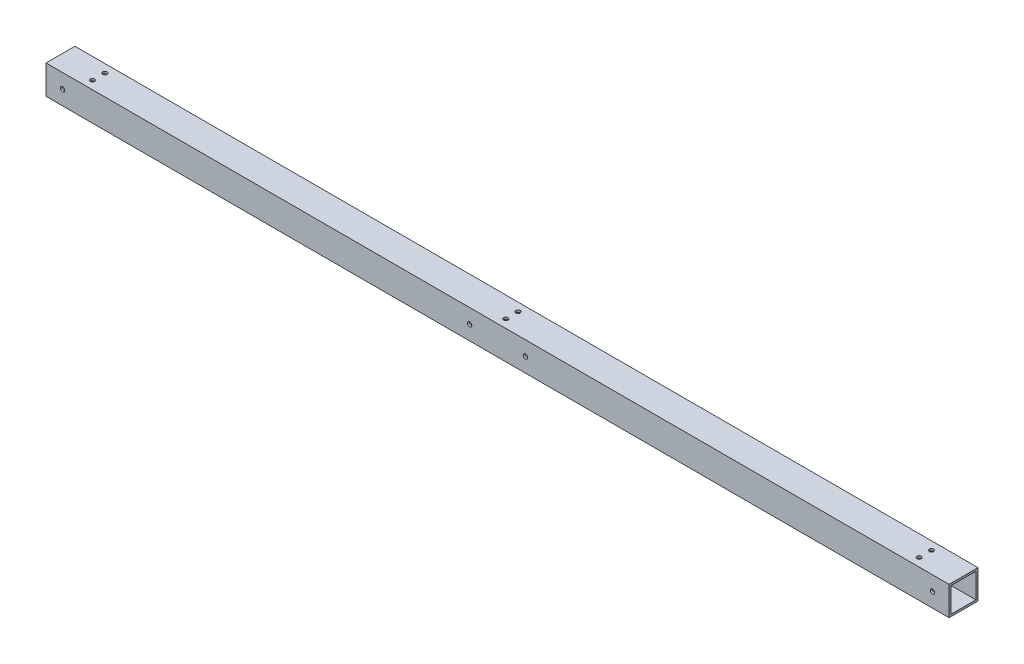
ISO-10303-21;
HEADER;
FILE_DESCRIPTION(('STEP AP214'),'2;1');
FILE_NAME('part.step','',(''),(''),'','','');
FILE_SCHEMA(('AUTOMOTIVE_DESIGN { 1 0 10303 214 1 1 1 1 }'));
ENDSEC;
DATA;
#1=APPLICATION_CONTEXT('core data for automotive mechanical design processes');
#2=APPLICATION_PROTOCOL_DEFINITION('international standard','automotive_design',2000,#1);
#3=PRODUCT_CONTEXT('',#1,'mechanical');
#4=PRODUCT('Part','Part','',(#3));
#5=PRODUCT_RELATED_PRODUCT_CATEGORY('part','',(#4));
#6=PRODUCT_DEFINITION_FORMATION('','',#4);
#7=PRODUCT_DEFINITION_CONTEXT('part definition',#1,'design');
#8=PRODUCT_DEFINITION('design','',#6,#7);
#9=PRODUCT_DEFINITION_SHAPE('','',#8);
#10=(LENGTH_UNIT() NAMED_UNIT(*) SI_UNIT(.MILLI.,.METRE.));
#11=(NAMED_UNIT(*) PLANE_ANGLE_UNIT() SI_UNIT($,.RADIAN.));
#12=(NAMED_UNIT(*) SI_UNIT($,.STERADIAN.) SOLID_ANGLE_UNIT());
#13=UNCERTAINTY_MEASURE_WITH_UNIT(LENGTH_MEASURE(1.E-05),#10,'distance_accuracy_value','');
#14=(GEOMETRIC_REPRESENTATION_CONTEXT(3) GLOBAL_UNCERTAINTY_ASSIGNED_CONTEXT((#13)) GLOBAL_UNIT_ASSIGNED_CONTEXT((#10,
#11,#12)) REPRESENTATION_CONTEXT('',''));
#15=CARTESIAN_POINT('',(0.,0.,0.));
#16=DIRECTION('',(0.,0.,1.));
#17=DIRECTION('',(1.,0.,0.));
#18=AXIS2_PLACEMENT_3D('',#15,#16,#17);
#19=CARTESIAN_POINT('',(-693.7375,-22.225,-22.225));
#20=DIRECTION('',(0.,0.,-1.));
#21=DIRECTION('',(-1.,0.,0.));
#22=AXIS2_PLACEMENT_3D('',#19,#20,#21);
#23=PLANE('',#22);
#24=CARTESIAN_POINT('',(42.8624999999999,2.33146835171283E-12,-22.225));
#25=DIRECTION('',(0.,0.,1.));
#26=DIRECTION('',(1.,0.,0.));
#27=AXIS2_PLACEMENT_3D('',#24,#25,#26);
#28=CIRCLE('',#27,3.37350099999999);
#29=CARTESIAN_POINT('',(46.2360009999999,2.33146835171283E-12,-22.225));
#30=VERTEX_POINT('',#29);
#31=EDGE_CURVE('E222',#30,#30,#28,.T.);
#32=ORIENTED_EDGE('',*,*,#31,.T.);
#33=EDGE_LOOP('',(#32));
#34=FACE_BOUND('',#33,.T.);
#35=CARTESIAN_POINT('',(-668.3375,0.,-22.225));
#36=DIRECTION('',(0.,0.,1.));
#37=DIRECTION('',(1.,0.,0.));
#38=AXIS2_PLACEMENT_3D('',#35,#36,#37);
#39=CIRCLE('',#38,3.373501);
#40=CARTESIAN_POINT('',(-664.963999,0.,-22.225));
#41=VERTEX_POINT('',#40);
#42=EDGE_CURVE('E216',#41,#41,#39,.T.);
#43=ORIENTED_EDGE('',*,*,#42,.T.);
#44=EDGE_LOOP('',(#43));
#45=FACE_BOUND('',#44,.T.);
#46=CARTESIAN_POINT('',(668.3375,2.33146835171283E-12,-22.225));
#47=DIRECTION('',(0.,0.,1.));
#48=DIRECTION('',(1.,0.,0.));
#49=AXIS2_PLACEMENT_3D('',#46,#47,#48);
#50=CIRCLE('',#49,3.373501);
#51=CARTESIAN_POINT('',(671.711001,2.33146835171283E-12,-22.225));
#52=VERTEX_POINT('',#51);
#53=EDGE_CURVE('E210',#52,#52,#50,.T.);
#54=ORIENTED_EDGE('',*,*,#53,.T.);
#55=EDGE_LOOP('',(#54));
#56=FACE_BOUND('',#55,.T.);
#57=CARTESIAN_POINT('',(-42.8625000000004,0.,-22.225));
#58=DIRECTION('',(0.,0.,1.));
#59=DIRECTION('',(1.,0.,0.));
#60=AXIS2_PLACEMENT_3D('',#57,#58,#59);
#61=CIRCLE('',#60,3.37350099999999);
#62=CARTESIAN_POINT('',(-39.4889990000004,0.,-22.225));
#63=VERTEX_POINT('',#62);
#64=EDGE_CURVE('E204',#63,#63,#61,.T.);
#65=ORIENTED_EDGE('',*,*,#64,.T.);
#66=EDGE_LOOP('',(#65));
#67=FACE_BOUND('',#66,.T.);
#68=DIRECTION('',(1.,0.,0.));
#69=VECTOR('',#68,1.);
#70=CARTESIAN_POINT('',(-693.7375,22.225,-22.225));
#71=LINE('',#70,#69);
#72=CARTESIAN_POINT('',(-693.7375,22.225,-22.225));
#73=VERTEX_POINT('',#72);
#74=CARTESIAN_POINT('',(693.7375,22.2250000000023,-22.225));
#75=VERTEX_POINT('',#74);
#76=EDGE_CURVE('E191',#73,#75,#71,.T.);
#77=ORIENTED_EDGE('',*,*,#76,.T.);
#78=DIRECTION('',(0.,1.,0.));
#79=VECTOR('',#78,1.);
#80=CARTESIAN_POINT('',(693.7375,-22.2249999999977,-22.225));
#81=LINE('',#80,#79);
#82=CARTESIAN_POINT('',(693.7375,-22.2249999999977,-22.225));
#83=VERTEX_POINT('',#82);
#84=EDGE_CURVE('E144',#83,#75,#81,.T.);
#85=ORIENTED_EDGE('',*,*,#84,.F.);
#86=DIRECTION('',(1.,0.,0.));
#87=VECTOR('',#86,1.);
#88=CARTESIAN_POINT('',(-693.7375,-22.225,-22.225));
#89=LINE('',#88,#87);
#90=CARTESIAN_POINT('',(-693.7375,-22.225,-22.225));
#91=VERTEX_POINT('',#90);
#92=EDGE_CURVE('E11',#91,#83,#89,.T.);
#93=ORIENTED_EDGE('',*,*,#92,.F.);
#94=DIRECTION('',(0.,1.,0.));
#95=VECTOR('',#94,1.);
#96=CARTESIAN_POINT('',(-693.7375,-22.225,-22.225));
#97=LINE('',#96,#95);
#98=EDGE_CURVE('E172',#91,#73,#97,.T.);
#99=ORIENTED_EDGE('',*,*,#98,.T.);
#100=EDGE_LOOP('',(#77,#85,#93,#99));
#101=FACE_BOUND('',#100,.T.);
#102=ADVANCED_FACE('F40',(#34,#45,#56,#67,#101),#23,.T.);
#103=CARTESIAN_POINT('',(-693.7375,-22.225,22.225));
#104=DIRECTION('',(0.,-1.,0.));
#105=DIRECTION('',(0.,0.,-1.));
#106=AXIS2_PLACEMENT_3D('',#103,#104,#105);
#107=PLANE('',#106);
#108=CARTESIAN_POINT('',(0.,-22.225,-9.525));
#109=DIRECTION('',(0.,-1.,0.));
#110=DIRECTION('',(0.,0.,-1.));
#111=AXIS2_PLACEMENT_3D('',#108,#109,#110);
#112=CIRCLE('',#111,3.37350099999999);
#113=CARTESIAN_POINT('',(0.,-22.225,-12.898501));
#114=VERTEX_POINT('',#113);
#115=EDGE_CURVE('E728',#114,#114,#112,.T.);
#116=ORIENTED_EDGE('',*,*,#115,.F.);
#117=EDGE_LOOP('',(#116));
#118=FACE_BOUND('',#117,.T.);
#119=CARTESIAN_POINT('',(0.,-22.225,9.525));
#120=DIRECTION('',(0.,-1.,0.));
#121=DIRECTION('',(0.,0.,-1.));
#122=AXIS2_PLACEMENT_3D('',#119,#120,#121);
#123=CIRCLE('',#122,3.37350099999999);
#124=CARTESIAN_POINT('',(0.,-22.225,6.15149900000001));
#125=VERTEX_POINT('',#124);
#126=EDGE_CURVE('E254',#125,#125,#123,.T.);
#127=ORIENTED_EDGE('',*,*,#126,.F.);
#128=EDGE_LOOP('',(#127));
#129=FACE_BOUND('',#128,.T.);
#130=CARTESIAN_POINT('',(635.,-22.2249999999977,-9.525));
#131=DIRECTION('',(0.,-1.,0.));
#132=DIRECTION('',(0.,0.,-1.));
#133=AXIS2_PLACEMENT_3D('',#130,#131,#132);
#134=CIRCLE('',#133,3.373501);
#135=CARTESIAN_POINT('',(635.,-22.2249999999977,-12.898501));
#136=VERTEX_POINT('',#135);
#137=EDGE_CURVE('E251',#136,#136,#134,.T.);
#138=ORIENTED_EDGE('',*,*,#137,.F.);
#139=EDGE_LOOP('',(#138));
#140=FACE_BOUND('',#139,.T.);
#141=CARTESIAN_POINT('',(635.,-22.2249999999977,9.525));
#142=DIRECTION('',(0.,-1.,0.));
#143=DIRECTION('',(0.,0.,-1.));
#144=AXIS2_PLACEMENT_3D('',#141,#142,#143);
#145=CIRCLE('',#144,3.373501);
#146=CARTESIAN_POINT('',(635.,-22.2249999999977,6.151499));
#147=VERTEX_POINT('',#146);
#148=EDGE_CURVE('E274',#147,#147,#145,.T.);
#149=ORIENTED_EDGE('',*,*,#148,.F.);
#150=EDGE_LOOP('',(#149));
#151=FACE_BOUND('',#150,.T.);
#152=CARTESIAN_POINT('',(-635.,-22.225,9.525));
#153=DIRECTION('',(0.,-1.,0.));
#154=DIRECTION('',(0.,0.,-1.));
#155=AXIS2_PLACEMENT_3D('',#152,#153,#154);
#156=CIRCLE('',#155,3.373501);
#157=CARTESIAN_POINT('',(-635.,-22.225,6.151499));
#158=VERTEX_POINT('',#157);
#159=EDGE_CURVE('E290',#158,#158,#156,.T.);
#160=ORIENTED_EDGE('',*,*,#159,.F.);
#161=EDGE_LOOP('',(#160));
#162=FACE_BOUND('',#161,.T.);
#163=CARTESIAN_POINT('',(-635.,-22.225,-9.525));
#164=DIRECTION('',(0.,-1.,0.));
#165=DIRECTION('',(0.,0.,-1.));
#166=AXIS2_PLACEMENT_3D('',#163,#164,#165);
#167=CIRCLE('',#166,3.373501);
#168=CARTESIAN_POINT('',(-635.,-22.225,-12.898501));
#169=VERTEX_POINT('',#168);
#170=EDGE_CURVE('E300',#169,#169,#167,.T.);
#171=ORIENTED_EDGE('',*,*,#170,.F.);
#172=EDGE_LOOP('',(#171));
#173=FACE_BOUND('',#172,.T.);
#174=ORIENTED_EDGE('',*,*,#92,.T.);
#175=DIRECTION('',(0.,0.,-1.));
#176=VECTOR('',#175,1.);
#177=CARTESIAN_POINT('',(693.7375,-22.2249999999977,22.225));
#178=LINE('',#177,#176);
#179=CARTESIAN_POINT('',(693.7375,-22.2249999999977,22.225));
#180=VERTEX_POINT('',#179);
#181=EDGE_CURVE('E156',#180,#83,#178,.T.);
#182=ORIENTED_EDGE('',*,*,#181,.F.);
#183=DIRECTION('',(1.,0.,0.));
#184=VECTOR('',#183,1.);
#185=CARTESIAN_POINT('',(-693.7375,-22.225,22.225));
#186=LINE('',#185,#184);
#187=CARTESIAN_POINT('',(-693.7375,-22.225,22.225));
#188=VERTEX_POINT('',#187);
#189=EDGE_CURVE('E49',#188,#180,#186,.T.);
#190=ORIENTED_EDGE('',*,*,#189,.F.);
#191=DIRECTION('',(0.,0.,-1.));
#192=VECTOR('',#191,1.);
#193=CARTESIAN_POINT('',(-693.7375,-22.225,22.225));
#194=LINE('',#193,#192);
#195=EDGE_CURVE('E188',#188,#91,#194,.T.);
#196=ORIENTED_EDGE('',*,*,#195,.T.);
#197=EDGE_LOOP('',(#174,#182,#190,#196));
#198=FACE_BOUND('',#197,.T.);
#199=ADVANCED_FACE('F369',(#118,#129,#140,#151,#162,#173,#198),#107,.T.);
#200=CARTESIAN_POINT('',(-693.7375,-22.225,22.225));
#201=DIRECTION('',(0.,0.,1.));
#202=DIRECTION('',(1.,0.,0.));
#203=AXIS2_PLACEMENT_3D('',#200,#201,#202);
#204=PLANE('',#203);
#205=CARTESIAN_POINT('',(42.8624999999999,2.33146835171283E-12,22.225));
#206=DIRECTION('',(0.,0.,1.));
#207=DIRECTION('',(1.,0.,0.));
#208=AXIS2_PLACEMENT_3D('',#205,#206,#207);
#209=CIRCLE('',#208,3.37350099999999);
#210=CARTESIAN_POINT('',(46.2360009999999,2.33146835171283E-12,22.225));
#211=VERTEX_POINT('',#210);
#212=EDGE_CURVE('E310',#211,#211,#209,.T.);
#213=ORIENTED_EDGE('',*,*,#212,.F.);
#214=EDGE_LOOP('',(#213));
#215=FACE_BOUND('',#214,.T.);
#216=CARTESIAN_POINT('',(-668.3375,0.,22.225));
#217=DIRECTION('',(0.,0.,1.));
#218=DIRECTION('',(1.,0.,0.));
#219=AXIS2_PLACEMENT_3D('',#216,#217,#218);
#220=CIRCLE('',#219,3.373501);
#221=CARTESIAN_POINT('',(-664.963999,0.,22.225));
#222=VERTEX_POINT('',#221);
#223=EDGE_CURVE('E320',#222,#222,#220,.T.);
#224=ORIENTED_EDGE('',*,*,#223,.F.);
#225=EDGE_LOOP('',(#224));
#226=FACE_BOUND('',#225,.T.);
#227=CARTESIAN_POINT('',(668.3375,2.33146835171283E-12,22.225));
#228=DIRECTION('',(0.,0.,1.));
#229=DIRECTION('',(1.,0.,0.));
#230=AXIS2_PLACEMENT_3D('',#227,#228,#229);
#231=CIRCLE('',#230,3.373501);
#232=CARTESIAN_POINT('',(671.711001,2.33146835171283E-12,22.225));
#233=VERTEX_POINT('',#232);
#234=EDGE_CURVE('E330',#233,#233,#231,.T.);
#235=ORIENTED_EDGE('',*,*,#234,.F.);
#236=EDGE_LOOP('',(#235));
#237=FACE_BOUND('',#236,.T.);
#238=CARTESIAN_POINT('',(-42.8625000000004,0.,22.225));
#239=DIRECTION('',(0.,0.,1.));
#240=DIRECTION('',(1.,0.,0.));
#241=AXIS2_PLACEMENT_3D('',#238,#239,#240);
#242=CIRCLE('',#241,3.37350099999999);
#243=CARTESIAN_POINT('',(-39.4889990000004,0.,22.225));
#244=VERTEX_POINT('',#243);
#245=EDGE_CURVE('E340',#244,#244,#242,.T.);
#246=ORIENTED_EDGE('',*,*,#245,.F.);
#247=EDGE_LOOP('',(#246));
#248=FACE_BOUND('',#247,.T.);
#249=ORIENTED_EDGE('',*,*,#189,.T.);
#250=DIRECTION('',(0.,-1.,0.));
#251=VECTOR('',#250,1.);
#252=CARTESIAN_POINT('',(693.7375,-22.2249999999977,22.225));
#253=LINE('',#252,#251);
#254=CARTESIAN_POINT('',(693.7375,22.2250000000023,22.225));
#255=VERTEX_POINT('',#254);
#256=EDGE_CURVE('E152',#255,#180,#253,.T.);
#257=ORIENTED_EDGE('',*,*,#256,.F.);
#258=DIRECTION('',(1.,0.,0.));
#259=VECTOR('',#258,1.);
#260=CARTESIAN_POINT('',(-693.7375,22.225,22.225));
#261=LINE('',#260,#259);
#262=CARTESIAN_POINT('',(-693.7375,22.225,22.225));
#263=VERTEX_POINT('',#262);
#264=EDGE_CURVE('E195',#263,#255,#261,.T.);
#265=ORIENTED_EDGE('',*,*,#264,.F.);
#266=DIRECTION('',(0.,-1.,0.));
#267=VECTOR('',#266,1.);
#268=CARTESIAN_POINT('',(-693.7375,-22.225,22.225));
#269=LINE('',#268,#267);
#270=EDGE_CURVE('E184',#263,#188,#269,.T.);
#271=ORIENTED_EDGE('',*,*,#270,.T.);
#272=EDGE_LOOP('',(#249,#257,#265,#271));
#273=FACE_BOUND('',#272,.T.);
#274=ADVANCED_FACE('F374',(#215,#226,#237,#248,#273),#204,.T.);
#275=CARTESIAN_POINT('',(-693.7375,22.225,22.225));
#276=DIRECTION('',(0.,1.,0.));
#277=DIRECTION('',(0.,0.,1.));
#278=AXIS2_PLACEMENT_3D('',#275,#276,#277);
#279=PLANE('',#278);
#280=CARTESIAN_POINT('',(0.,22.225,-9.525));
#281=DIRECTION('',(0.,-1.,0.));
#282=DIRECTION('',(0.,0.,-1.));
#283=AXIS2_PLACEMENT_3D('',#280,#281,#282);
#284=CIRCLE('',#283,3.37350099999999);
#285=CARTESIAN_POINT('',(0.,22.225,-12.898501));
#286=VERTEX_POINT('',#285);
#287=EDGE_CURVE('E718',#286,#286,#284,.T.);
#288=ORIENTED_EDGE('',*,*,#287,.T.);
#289=EDGE_LOOP('',(#288));
#290=FACE_BOUND('',#289,.T.);
#291=CARTESIAN_POINT('',(0.,22.225,9.525));
#292=DIRECTION('',(0.,-1.,0.));
#293=DIRECTION('',(0.,0.,-1.));
#294=AXIS2_PLACEMENT_3D('',#291,#292,#293);
#295=CIRCLE('',#294,3.37350099999999);
#296=CARTESIAN_POINT('',(0.,22.225,6.15149900000001));
#297=VERTEX_POINT('',#296);
#298=EDGE_CURVE('E244',#297,#297,#295,.T.);
#299=ORIENTED_EDGE('',*,*,#298,.T.);
#300=EDGE_LOOP('',(#299));
#301=FACE_BOUND('',#300,.T.);
#302=CARTESIAN_POINT('',(635.,22.2250000000023,-9.525));
#303=DIRECTION('',(0.,-1.,0.));
#304=DIRECTION('',(0.,0.,-1.));
#305=AXIS2_PLACEMENT_3D('',#302,#303,#304);
#306=CIRCLE('',#305,3.373501);
#307=CARTESIAN_POINT('',(635.,22.2250000000023,-12.898501));
#308=VERTEX_POINT('',#307);
#309=EDGE_CURVE('E239',#308,#308,#306,.T.);
#310=ORIENTED_EDGE('',*,*,#309,.T.);
#311=EDGE_LOOP('',(#310));
#312=FACE_BOUND('',#311,.T.);
#313=CARTESIAN_POINT('',(635.,22.2250000000023,9.525));
#314=DIRECTION('',(0.,-1.,0.));
#315=DIRECTION('',(0.,0.,-1.));
#316=AXIS2_PLACEMENT_3D('',#313,#314,#315);
#317=CIRCLE('',#316,3.373501);
#318=CARTESIAN_POINT('',(635.,22.2250000000023,6.151499));
#319=VERTEX_POINT('',#318);
#320=EDGE_CURVE('E278',#319,#319,#317,.T.);
#321=ORIENTED_EDGE('',*,*,#320,.T.);
#322=EDGE_LOOP('',(#321));
#323=FACE_BOUND('',#322,.T.);
#324=CARTESIAN_POINT('',(-635.,22.225,9.525));
#325=DIRECTION('',(0.,-1.,0.));
#326=DIRECTION('',(0.,0.,-1.));
#327=AXIS2_PLACEMENT_3D('',#324,#325,#326);
#328=CIRCLE('',#327,3.373501);
#329=CARTESIAN_POINT('',(-635.,22.225,6.151499));
#330=VERTEX_POINT('',#329);
#331=EDGE_CURVE('E234',#330,#330,#328,.T.);
#332=ORIENTED_EDGE('',*,*,#331,.T.);
#333=EDGE_LOOP('',(#332));
#334=FACE_BOUND('',#333,.T.);
#335=CARTESIAN_POINT('',(-635.,22.225,-9.525));
#336=DIRECTION('',(0.,-1.,0.));
#337=DIRECTION('',(0.,0.,-1.));
#338=AXIS2_PLACEMENT_3D('',#335,#336,#337);
#339=CIRCLE('',#338,3.373501);
#340=CARTESIAN_POINT('',(-635.,22.225,-12.898501));
#341=VERTEX_POINT('',#340);
#342=EDGE_CURVE('E228',#341,#341,#339,.T.);
#343=ORIENTED_EDGE('',*,*,#342,.T.);
#344=EDGE_LOOP('',(#343));
#345=FACE_BOUND('',#344,.T.);
#346=ORIENTED_EDGE('',*,*,#264,.T.);
#347=DIRECTION('',(0.,0.,1.));
#348=VECTOR('',#347,1.);
#349=CARTESIAN_POINT('',(693.7375,22.2250000000023,22.225));
#350=LINE('',#349,#348);
#351=EDGE_CURVE('E148',#75,#255,#350,.T.);
#352=ORIENTED_EDGE('',*,*,#351,.F.);
#353=ORIENTED_EDGE('',*,*,#76,.F.);
#354=DIRECTION('',(0.,0.,1.));
#355=VECTOR('',#354,1.);
#356=CARTESIAN_POINT('',(-693.7375,22.225,22.225));
#357=LINE('',#356,#355);
#358=EDGE_CURVE('E180',#73,#263,#357,.T.);
#359=ORIENTED_EDGE('',*,*,#358,.T.);
#360=EDGE_LOOP('',(#346,#352,#353,#359));
#361=FACE_BOUND('',#360,.T.);
#362=ADVANCED_FACE('F386',(#290,#301,#312,#323,#334,#345,#361),#279,.T.);
#363=CARTESIAN_POINT('',(-693.7375,0.,0.));
#364=DIRECTION('',(-1.,0.,0.));
#365=DIRECTION('',(0.,0.,1.));
#366=AXIS2_PLACEMENT_3D('',#363,#364,#365);
#367=PLANE('',#366);
#368=DIRECTION('',(0.,1.,0.));
#369=VECTOR('',#368,1.);
#370=CARTESIAN_POINT('',(-693.7375,-19.05,-19.05));
#371=LINE('',#370,#369);
#372=CARTESIAN_POINT('',(-693.7375,-19.05,-19.05));
#373=VERTEX_POINT('',#372);
#374=CARTESIAN_POINT('',(-693.7375,19.05,-19.05));
#375=VERTEX_POINT('',#374);
#376=EDGE_CURVE('E160',#373,#375,#371,.T.);
#377=ORIENTED_EDGE('',*,*,#376,.T.);
#378=DIRECTION('',(0.,0.,1.));
#379=VECTOR('',#378,1.);
#380=CARTESIAN_POINT('',(-693.7375,19.05,19.05));
#381=LINE('',#380,#379);
#382=CARTESIAN_POINT('',(-693.7375,19.05,19.05));
#383=VERTEX_POINT('',#382);
#384=EDGE_CURVE('E113',#375,#383,#381,.T.);
#385=ORIENTED_EDGE('',*,*,#384,.T.);
#386=DIRECTION('',(0.,-1.,0.));
#387=VECTOR('',#386,1.);
#388=CARTESIAN_POINT('',(-693.7375,-19.05,19.05));
#389=LINE('',#388,#387);
#390=CARTESIAN_POINT('',(-693.7375,-19.05,19.05));
#391=VERTEX_POINT('',#390);
#392=EDGE_CURVE('E57',#383,#391,#389,.T.);
#393=ORIENTED_EDGE('',*,*,#392,.T.);
#394=DIRECTION('',(0.,0.,-1.));
#395=VECTOR('',#394,1.);
#396=CARTESIAN_POINT('',(-693.7375,-19.05,19.05));
#397=LINE('',#396,#395);
#398=EDGE_CURVE('E119',#391,#373,#397,.T.);
#399=ORIENTED_EDGE('',*,*,#398,.T.);
#400=EDGE_LOOP('',(#377,#385,#393,#399));
#401=FACE_BOUND('',#400,.T.);
#402=ORIENTED_EDGE('',*,*,#98,.F.);
#403=ORIENTED_EDGE('',*,*,#195,.F.);
#404=ORIENTED_EDGE('',*,*,#270,.F.);
#405=ORIENTED_EDGE('',*,*,#358,.F.);
#406=EDGE_LOOP('',(#402,#403,#404,#405));
#407=FACE_BOUND('',#406,.T.);
#408=ADVANCED_FACE('F394',(#401,#407),#367,.T.);
#409=CARTESIAN_POINT('',(-693.7375,-19.05,-19.05));
#410=DIRECTION('',(0.,0.,-1.));
#411=DIRECTION('',(-1.,0.,0.));
#412=AXIS2_PLACEMENT_3D('',#409,#410,#411);
#413=PLANE('',#412);
#414=CARTESIAN_POINT('',(42.8624999999999,2.33146835171283E-12,-19.05));
#415=DIRECTION('',(0.,0.,-1.));
#416=DIRECTION('',(-1.,0.,0.));
#417=AXIS2_PLACEMENT_3D('',#414,#415,#416);
#418=CIRCLE('',#417,3.37350099999999);
#419=CARTESIAN_POINT('',(39.4889989999999,2.33146835171283E-12,-19.05));
#420=VERTEX_POINT('',#419);
#421=EDGE_CURVE('E221',#420,#420,#418,.T.);
#422=ORIENTED_EDGE('',*,*,#421,.T.);
#423=EDGE_LOOP('',(#422));
#424=FACE_BOUND('',#423,.T.);
#425=CARTESIAN_POINT('',(-668.3375,0.,-19.05));
#426=DIRECTION('',(0.,0.,-1.));
#427=DIRECTION('',(-1.,0.,0.));
#428=AXIS2_PLACEMENT_3D('',#425,#426,#427);
#429=CIRCLE('',#428,3.373501);
#430=CARTESIAN_POINT('',(-671.711001,0.,-19.05));
#431=VERTEX_POINT('',#430);
#432=EDGE_CURVE('E211',#431,#431,#429,.T.);
#433=ORIENTED_EDGE('',*,*,#432,.T.);
#434=EDGE_LOOP('',(#433));
#435=FACE_BOUND('',#434,.T.);
#436=CARTESIAN_POINT('',(668.3375,2.33146835171283E-12,-19.05));
#437=DIRECTION('',(0.,0.,-1.));
#438=DIRECTION('',(-1.,0.,0.));
#439=AXIS2_PLACEMENT_3D('',#436,#437,#438);
#440=CIRCLE('',#439,3.373501);
#441=CARTESIAN_POINT('',(664.963999,2.33146835171283E-12,-19.05));
#442=VERTEX_POINT('',#441);
#443=EDGE_CURVE('E205',#442,#442,#440,.T.);
#444=ORIENTED_EDGE('',*,*,#443,.T.);
#445=EDGE_LOOP('',(#444));
#446=FACE_BOUND('',#445,.T.);
#447=CARTESIAN_POINT('',(-42.8625000000004,0.,-19.05));
#448=DIRECTION('',(0.,0.,-1.));
#449=DIRECTION('',(-1.,0.,0.));
#450=AXIS2_PLACEMENT_3D('',#447,#448,#449);
#451=CIRCLE('',#450,3.37350099999999);
#452=CARTESIAN_POINT('',(-46.2360010000003,0.,-19.05));
#453=VERTEX_POINT('',#452);
#454=EDGE_CURVE('E129',#453,#453,#451,.T.);
#455=ORIENTED_EDGE('',*,*,#454,.T.);
#456=EDGE_LOOP('',(#455));
#457=FACE_BOUND('',#456,.T.);
#458=DIRECTION('',(1.,0.,0.));
#459=VECTOR('',#458,1.);
#460=CARTESIAN_POINT('',(-693.7375,-19.05,-19.05));
#461=LINE('',#460,#459);
#462=CARTESIAN_POINT('',(693.7375,-19.0499999999977,-19.05));
#463=VERTEX_POINT('',#462);
#464=EDGE_CURVE('E124',#373,#463,#461,.T.);
#465=ORIENTED_EDGE('',*,*,#464,.T.);
#466=DIRECTION('',(0.,1.,0.));
#467=VECTOR('',#466,1.);
#468=CARTESIAN_POINT('',(693.7375,-19.0499999999977,-19.05));
#469=LINE('',#468,#467);
#470=CARTESIAN_POINT('',(693.7375,19.0500000000023,-19.05));
#471=VERTEX_POINT('',#470);
#472=EDGE_CURVE('E122',#463,#471,#469,.T.);
#473=ORIENTED_EDGE('',*,*,#472,.T.);
#474=DIRECTION('',(1.,0.,0.));
#475=VECTOR('',#474,1.);
#476=CARTESIAN_POINT('',(-693.7375,19.05,-19.05));
#477=LINE('',#476,#475);
#478=EDGE_CURVE('E106',#375,#471,#477,.T.);
#479=ORIENTED_EDGE('',*,*,#478,.F.);
#480=ORIENTED_EDGE('',*,*,#376,.F.);
#481=EDGE_LOOP('',(#465,#473,#479,#480));
#482=FACE_BOUND('',#481,.T.);
#483=ADVANCED_FACE('F123',(#424,#435,#446,#457,#482),#413,.F.);
#484=CARTESIAN_POINT('',(-693.7375,-19.05,19.05));
#485=DIRECTION('',(0.,-1.,0.));
#486=DIRECTION('',(0.,0.,-1.));
#487=AXIS2_PLACEMENT_3D('',#484,#485,#486);
#488=PLANE('',#487);
#489=CARTESIAN_POINT('',(0.,-19.05,-9.525));
#490=DIRECTION('',(0.,-1.,0.));
#491=DIRECTION('',(0.,0.,-1.));
#492=AXIS2_PLACEMENT_3D('',#489,#490,#491);
#493=CIRCLE('',#492,3.37350099999999);
#494=CARTESIAN_POINT('',(0.,-19.05,-12.898501));
#495=VERTEX_POINT('',#494);
#496=EDGE_CURVE('E43',#495,#495,#493,.T.);
#497=ORIENTED_EDGE('',*,*,#496,.T.);
#498=EDGE_LOOP('',(#497));
#499=FACE_BOUND('',#498,.T.);
#500=CARTESIAN_POINT('',(0.,-19.05,9.525));
#501=DIRECTION('',(0.,-1.,0.));
#502=DIRECTION('',(0.,0.,-1.));
#503=AXIS2_PLACEMENT_3D('',#500,#501,#502);
#504=CIRCLE('',#503,3.37350099999999);
#505=CARTESIAN_POINT('',(0.,-19.05,6.15149900000001));
#506=VERTEX_POINT('',#505);
#507=EDGE_CURVE('E243',#506,#506,#504,.T.);
#508=ORIENTED_EDGE('',*,*,#507,.T.);
#509=EDGE_LOOP('',(#508));
#510=FACE_BOUND('',#509,.T.);
#511=CARTESIAN_POINT('',(635.,-19.0499999999977,-9.525));
#512=DIRECTION('',(0.,-1.,0.));
#513=DIRECTION('',(0.,0.,-1.));
#514=AXIS2_PLACEMENT_3D('',#511,#512,#513);
#515=CIRCLE('',#514,3.373501);
#516=CARTESIAN_POINT('',(635.,-19.0499999999977,-12.898501));
#517=VERTEX_POINT('',#516);
#518=EDGE_CURVE('E238',#517,#517,#515,.T.);
#519=ORIENTED_EDGE('',*,*,#518,.T.);
#520=EDGE_LOOP('',(#519));
#521=FACE_BOUND('',#520,.T.);
#522=CARTESIAN_POINT('',(635.,-19.0499999999977,9.525));
#523=DIRECTION('',(0.,-1.,0.));
#524=DIRECTION('',(0.,0.,-1.));
#525=AXIS2_PLACEMENT_3D('',#522,#523,#524);
#526=CIRCLE('',#525,3.373501);
#527=CARTESIAN_POINT('',(635.,-19.0499999999977,6.151499));
#528=VERTEX_POINT('',#527);
#529=EDGE_CURVE('E282',#528,#528,#526,.T.);
#530=ORIENTED_EDGE('',*,*,#529,.T.);
#531=EDGE_LOOP('',(#530));
#532=FACE_BOUND('',#531,.T.);
#533=CARTESIAN_POINT('',(-635.,-19.05,9.525));
#534=DIRECTION('',(0.,-1.,0.));
#535=DIRECTION('',(0.,0.,-1.));
#536=AXIS2_PLACEMENT_3D('',#533,#534,#535);
#537=CIRCLE('',#536,3.373501);
#538=CARTESIAN_POINT('',(-635.,-19.05,6.151499));
#539=VERTEX_POINT('',#538);
#540=EDGE_CURVE('E233',#539,#539,#537,.T.);
#541=ORIENTED_EDGE('',*,*,#540,.T.);
#542=EDGE_LOOP('',(#541));
#543=FACE_BOUND('',#542,.T.);
#544=CARTESIAN_POINT('',(-635.,-19.05,-9.525));
#545=DIRECTION('',(0.,-1.,0.));
#546=DIRECTION('',(0.,0.,-1.));
#547=AXIS2_PLACEMENT_3D('',#544,#545,#546);
#548=CIRCLE('',#547,3.373501);
#549=CARTESIAN_POINT('',(-635.,-19.05,-12.898501));
#550=VERTEX_POINT('',#549);
#551=EDGE_CURVE('E223',#550,#550,#548,.T.);
#552=ORIENTED_EDGE('',*,*,#551,.T.);
#553=EDGE_LOOP('',(#552));
#554=FACE_BOUND('',#553,.T.);
#555=DIRECTION('',(1.,0.,0.));
#556=VECTOR('',#555,1.);
#557=CARTESIAN_POINT('',(-693.7375,-19.05,19.05));
#558=LINE('',#557,#556);
#559=CARTESIAN_POINT('',(693.7375,-19.0499999999977,19.05));
#560=VERTEX_POINT('',#559);
#561=EDGE_CURVE('E173',#391,#560,#558,.T.);
#562=ORIENTED_EDGE('',*,*,#561,.T.);
#563=DIRECTION('',(0.,0.,-1.));
#564=VECTOR('',#563,1.);
#565=CARTESIAN_POINT('',(693.7375,-19.0499999999977,19.05));
#566=LINE('',#565,#564);
#567=EDGE_CURVE('E138',#560,#463,#566,.T.);
#568=ORIENTED_EDGE('',*,*,#567,.T.);
#569=ORIENTED_EDGE('',*,*,#464,.F.);
#570=ORIENTED_EDGE('',*,*,#398,.F.);
#571=EDGE_LOOP('',(#562,#568,#569,#570));
#572=FACE_BOUND('',#571,.T.);
#573=ADVANCED_FACE('F411',(#499,#510,#521,#532,#543,#554,#572),#488,.F.);
#574=CARTESIAN_POINT('',(-693.7375,-19.05,19.05));
#575=DIRECTION('',(0.,0.,1.));
#576=DIRECTION('',(1.,0.,0.));
#577=AXIS2_PLACEMENT_3D('',#574,#575,#576);
#578=PLANE('',#577);
#579=CARTESIAN_POINT('',(42.8624999999999,2.33146835171283E-12,19.05));
#580=DIRECTION('',(0.,0.,1.));
#581=DIRECTION('',(1.,0.,0.));
#582=AXIS2_PLACEMENT_3D('',#579,#580,#581);
#583=CIRCLE('',#582,3.37350099999999);
#584=CARTESIAN_POINT('',(46.2360009999999,2.33146835171283E-12,19.05));
#585=VERTEX_POINT('',#584);
#586=EDGE_CURVE('E217',#585,#585,#583,.T.);
#587=ORIENTED_EDGE('',*,*,#586,.T.);
#588=EDGE_LOOP('',(#587));
#589=FACE_BOUND('',#588,.T.);
#590=CARTESIAN_POINT('',(-668.3375,0.,19.05));
#591=DIRECTION('',(0.,0.,1.));
#592=DIRECTION('',(1.,0.,0.));
#593=AXIS2_PLACEMENT_3D('',#590,#591,#592);
#594=CIRCLE('',#593,3.373501);
#595=CARTESIAN_POINT('',(-664.963999,0.,19.05));
#596=VERTEX_POINT('',#595);
#597=EDGE_CURVE('E215',#596,#596,#594,.T.);
#598=ORIENTED_EDGE('',*,*,#597,.T.);
#599=EDGE_LOOP('',(#598));
#600=FACE_BOUND('',#599,.T.);
#601=CARTESIAN_POINT('',(668.3375,2.33146835171283E-12,19.05));
#602=DIRECTION('',(0.,0.,1.));
#603=DIRECTION('',(1.,0.,0.));
#604=AXIS2_PLACEMENT_3D('',#601,#602,#603);
#605=CIRCLE('',#604,3.373501);
#606=CARTESIAN_POINT('',(671.711001,2.33146835171283E-12,19.05));
#607=VERTEX_POINT('',#606);
#608=EDGE_CURVE('E209',#607,#607,#605,.T.);
#609=ORIENTED_EDGE('',*,*,#608,.T.);
#610=EDGE_LOOP('',(#609));
#611=FACE_BOUND('',#610,.T.);
#612=CARTESIAN_POINT('',(-42.8625000000004,0.,19.05));
#613=DIRECTION('',(0.,0.,1.));
#614=DIRECTION('',(1.,0.,0.));
#615=AXIS2_PLACEMENT_3D('',#612,#613,#614);
#616=CIRCLE('',#615,3.37350099999999);
#617=CARTESIAN_POINT('',(-39.4889990000004,0.,19.05));
#618=VERTEX_POINT('',#617);
#619=EDGE_CURVE('E200',#618,#618,#616,.T.);
#620=ORIENTED_EDGE('',*,*,#619,.T.);
#621=EDGE_LOOP('',(#620));
#622=FACE_BOUND('',#621,.T.);
#623=DIRECTION('',(1.,0.,0.));
#624=VECTOR('',#623,1.);
#625=CARTESIAN_POINT('',(-693.7375,19.05,19.05));
#626=LINE('',#625,#624);
#627=CARTESIAN_POINT('',(693.7375,19.0500000000023,19.05));
#628=VERTEX_POINT('',#627);
#629=EDGE_CURVE('E118',#383,#628,#626,.T.);
#630=ORIENTED_EDGE('',*,*,#629,.T.);
#631=DIRECTION('',(0.,-1.,0.));
#632=VECTOR('',#631,1.);
#633=CARTESIAN_POINT('',(693.7375,-19.0499999999977,19.05));
#634=LINE('',#633,#632);
#635=EDGE_CURVE('E133',#628,#560,#634,.T.);
#636=ORIENTED_EDGE('',*,*,#635,.T.);
#637=ORIENTED_EDGE('',*,*,#561,.F.);
#638=ORIENTED_EDGE('',*,*,#392,.F.);
#639=EDGE_LOOP('',(#630,#636,#637,#638));
#640=FACE_BOUND('',#639,.T.);
#641=ADVANCED_FACE('F415',(#589,#600,#611,#622,#640),#578,.F.);
#642=CARTESIAN_POINT('',(-693.7375,19.05,19.05));
#643=DIRECTION('',(0.,1.,0.));
#644=DIRECTION('',(0.,0.,1.));
#645=AXIS2_PLACEMENT_3D('',#642,#643,#644);
#646=PLANE('',#645);
#647=CARTESIAN_POINT('',(0.,19.05,-9.525));
#648=DIRECTION('',(0.,1.,0.));
#649=DIRECTION('',(0.,0.,1.));
#650=AXIS2_PLACEMENT_3D('',#647,#648,#649);
#651=CIRCLE('',#650,3.37350099999999);
#652=CARTESIAN_POINT('',(0.,19.05,-6.15149900000001));
#653=VERTEX_POINT('',#652);
#654=EDGE_CURVE('E261',#653,#653,#651,.T.);
#655=ORIENTED_EDGE('',*,*,#654,.T.);
#656=EDGE_LOOP('',(#655));
#657=FACE_BOUND('',#656,.T.);
#658=CARTESIAN_POINT('',(0.,19.05,9.525));
#659=DIRECTION('',(0.,1.,0.));
#660=DIRECTION('',(0.,0.,1.));
#661=AXIS2_PLACEMENT_3D('',#658,#659,#660);
#662=CIRCLE('',#661,3.37350099999999);
#663=CARTESIAN_POINT('',(0.,19.05,12.898501));
#664=VERTEX_POINT('',#663);
#665=EDGE_CURVE('E240',#664,#664,#662,.T.);
#666=ORIENTED_EDGE('',*,*,#665,.T.);
#667=EDGE_LOOP('',(#666));
#668=FACE_BOUND('',#667,.T.);
#669=CARTESIAN_POINT('',(635.,19.0500000000023,-9.525));
#670=DIRECTION('',(0.,1.,0.));
#671=DIRECTION('',(0.,0.,1.));
#672=AXIS2_PLACEMENT_3D('',#669,#670,#671);
#673=CIRCLE('',#672,3.373501);
#674=CARTESIAN_POINT('',(635.,19.0500000000023,-6.151499));
#675=VERTEX_POINT('',#674);
#676=EDGE_CURVE('E235',#675,#675,#673,.T.);
#677=ORIENTED_EDGE('',*,*,#676,.T.);
#678=EDGE_LOOP('',(#677));
#679=FACE_BOUND('',#678,.T.);
#680=CARTESIAN_POINT('',(635.,19.0500000000023,9.525));
#681=DIRECTION('',(0.,1.,0.));
#682=DIRECTION('',(0.,0.,1.));
#683=AXIS2_PLACEMENT_3D('',#680,#681,#682);
#684=CIRCLE('',#683,3.373501);
#685=CARTESIAN_POINT('',(635.,19.0500000000023,12.898501));
#686=VERTEX_POINT('',#685);
#687=EDGE_CURVE('E286',#686,#686,#684,.T.);
#688=ORIENTED_EDGE('',*,*,#687,.T.);
#689=EDGE_LOOP('',(#688));
#690=FACE_BOUND('',#689,.T.);
#691=CARTESIAN_POINT('',(-635.,19.05,9.525));
#692=DIRECTION('',(0.,1.,0.));
#693=DIRECTION('',(0.,0.,1.));
#694=AXIS2_PLACEMENT_3D('',#691,#692,#693);
#695=CIRCLE('',#694,3.373501);
#696=CARTESIAN_POINT('',(-635.,19.05,12.898501));
#697=VERTEX_POINT('',#696);
#698=EDGE_CURVE('E229',#697,#697,#695,.T.);
#699=ORIENTED_EDGE('',*,*,#698,.T.);
#700=EDGE_LOOP('',(#699));
#701=FACE_BOUND('',#700,.T.);
#702=CARTESIAN_POINT('',(-635.,19.05,-9.525));
#703=DIRECTION('',(0.,1.,0.));
#704=DIRECTION('',(0.,0.,1.));
#705=AXIS2_PLACEMENT_3D('',#702,#703,#704);
#706=CIRCLE('',#705,3.373501);
#707=CARTESIAN_POINT('',(-635.,19.05,-6.151499));
#708=VERTEX_POINT('',#707);
#709=EDGE_CURVE('E227',#708,#708,#706,.T.);
#710=ORIENTED_EDGE('',*,*,#709,.T.);
#711=EDGE_LOOP('',(#710));
#712=FACE_BOUND('',#711,.T.);
#713=ORIENTED_EDGE('',*,*,#478,.T.);
#714=DIRECTION('',(0.,0.,1.));
#715=VECTOR('',#714,1.);
#716=CARTESIAN_POINT('',(693.7375,19.0500000000023,19.05));
#717=LINE('',#716,#715);
#718=EDGE_CURVE('E110',#471,#628,#717,.T.);
#719=ORIENTED_EDGE('',*,*,#718,.T.);
#720=ORIENTED_EDGE('',*,*,#629,.F.);
#721=ORIENTED_EDGE('',*,*,#384,.F.);
#722=EDGE_LOOP('',(#713,#719,#720,#721));
#723=FACE_BOUND('',#722,.T.);
#724=ADVANCED_FACE('F108',(#657,#668,#679,#690,#701,#712,#723),#646,.F.);
#725=CARTESIAN_POINT('',(693.7375,2.33146835171283E-12,0.));
#726=DIRECTION('',(-1.,0.,0.));
#727=DIRECTION('',(0.,0.,1.));
#728=AXIS2_PLACEMENT_3D('',#725,#726,#727);
#729=PLANE('',#728);
#730=ORIENTED_EDGE('',*,*,#84,.T.);
#731=ORIENTED_EDGE('',*,*,#351,.T.);
#732=ORIENTED_EDGE('',*,*,#256,.T.);
#733=ORIENTED_EDGE('',*,*,#181,.T.);
#734=EDGE_LOOP('',(#730,#731,#732,#733));
#735=FACE_BOUND('',#734,.T.);
#736=ORIENTED_EDGE('',*,*,#472,.F.);
#737=ORIENTED_EDGE('',*,*,#567,.F.);
#738=ORIENTED_EDGE('',*,*,#635,.F.);
#739=ORIENTED_EDGE('',*,*,#718,.F.);
#740=EDGE_LOOP('',(#736,#737,#738,#739));
#741=FACE_BOUND('',#740,.T.);
#742=ADVANCED_FACE('F131',(#735,#741),#729,.F.);
#743=CARTESIAN_POINT('',(-42.8625000000004,0.,22.225));
#744=DIRECTION('',(0.,0.,1.));
#745=DIRECTION('',(1.,0.,0.));
#746=AXIS2_PLACEMENT_3D('',#743,#744,#745);
#747=CYLINDRICAL_SURFACE('',#746,3.37350099999999);
#748=ORIENTED_EDGE('',*,*,#245,.T.);
#749=EDGE_LOOP('',(#748));
#750=FACE_BOUND('',#749,.T.);
#751=ORIENTED_EDGE('',*,*,#619,.F.);
#752=EDGE_LOOP('',(#751));
#753=FACE_BOUND('',#752,.T.);
#754=ADVANCED_FACE('F355',(#750,#753),#747,.F.);
#755=ORIENTED_EDGE('',*,*,#64,.F.);
#756=EDGE_LOOP('',(#755));
#757=FACE_BOUND('',#756,.T.);
#758=ORIENTED_EDGE('',*,*,#454,.F.);
#759=EDGE_LOOP('',(#758));
#760=FACE_BOUND('',#759,.T.);
#761=ADVANCED_FACE('F352',(#757,#760),#747,.F.);
#762=CARTESIAN_POINT('',(668.3375,2.33146835171283E-12,22.225));
#763=DIRECTION('',(0.,0.,1.));
#764=DIRECTION('',(1.,0.,0.));
#765=AXIS2_PLACEMENT_3D('',#762,#763,#764);
#766=CYLINDRICAL_SURFACE('',#765,3.373501);
#767=ORIENTED_EDGE('',*,*,#53,.F.);
#768=EDGE_LOOP('',(#767));
#769=FACE_BOUND('',#768,.T.);
#770=ORIENTED_EDGE('',*,*,#443,.F.);
#771=EDGE_LOOP('',(#770));
#772=FACE_BOUND('',#771,.T.);
#773=ADVANCED_FACE('F354',(#769,#772),#766,.F.);
#774=ORIENTED_EDGE('',*,*,#234,.T.);
#775=EDGE_LOOP('',(#774));
#776=FACE_BOUND('',#775,.T.);
#777=ORIENTED_EDGE('',*,*,#608,.F.);
#778=EDGE_LOOP('',(#777));
#779=FACE_BOUND('',#778,.T.);
#780=ADVANCED_FACE('F362',(#776,#779),#766,.F.);
#781=CARTESIAN_POINT('',(-668.3375,0.,22.225));
#782=DIRECTION('',(0.,0.,1.));
#783=DIRECTION('',(1.,0.,0.));
#784=AXIS2_PLACEMENT_3D('',#781,#782,#783);
#785=CYLINDRICAL_SURFACE('',#784,3.373501);
#786=ORIENTED_EDGE('',*,*,#42,.F.);
#787=EDGE_LOOP('',(#786));
#788=FACE_BOUND('',#787,.T.);
#789=ORIENTED_EDGE('',*,*,#432,.F.);
#790=EDGE_LOOP('',(#789));
#791=FACE_BOUND('',#790,.T.);
#792=ADVANCED_FACE('F450',(#788,#791),#785,.F.);
#793=ORIENTED_EDGE('',*,*,#223,.T.);
#794=EDGE_LOOP('',(#793));
#795=FACE_BOUND('',#794,.T.);
#796=ORIENTED_EDGE('',*,*,#597,.F.);
#797=EDGE_LOOP('',(#796));
#798=FACE_BOUND('',#797,.T.);
#799=ADVANCED_FACE('F459',(#795,#798),#785,.F.);
#800=CARTESIAN_POINT('',(42.8624999999999,2.33146835171283E-12,22.225));
#801=DIRECTION('',(0.,0.,1.));
#802=DIRECTION('',(1.,0.,0.));
#803=AXIS2_PLACEMENT_3D('',#800,#801,#802);
#804=CYLINDRICAL_SURFACE('',#803,3.37350099999999);
#805=ORIENTED_EDGE('',*,*,#212,.T.);
#806=EDGE_LOOP('',(#805));
#807=FACE_BOUND('',#806,.T.);
#808=ORIENTED_EDGE('',*,*,#586,.F.);
#809=EDGE_LOOP('',(#808));
#810=FACE_BOUND('',#809,.T.);
#811=ADVANCED_FACE('F469',(#807,#810),#804,.F.);
#812=ORIENTED_EDGE('',*,*,#31,.F.);
#813=EDGE_LOOP('',(#812));
#814=FACE_BOUND('',#813,.T.);
#815=ORIENTED_EDGE('',*,*,#421,.F.);
#816=EDGE_LOOP('',(#815));
#817=FACE_BOUND('',#816,.T.);
#818=ADVANCED_FACE('F478',(#814,#817),#804,.F.);
#819=CARTESIAN_POINT('',(-635.,-22.225,-9.525));
#820=DIRECTION('',(0.,-1.,0.));
#821=DIRECTION('',(0.,0.,-1.));
#822=AXIS2_PLACEMENT_3D('',#819,#820,#821);
#823=CYLINDRICAL_SURFACE('',#822,3.373501);
#824=ORIENTED_EDGE('',*,*,#170,.T.);
#825=EDGE_LOOP('',(#824));
#826=FACE_BOUND('',#825,.T.);
#827=ORIENTED_EDGE('',*,*,#551,.F.);
#828=EDGE_LOOP('',(#827));
#829=FACE_BOUND('',#828,.T.);
#830=ADVANCED_FACE('F488',(#826,#829),#823,.F.);
#831=ORIENTED_EDGE('',*,*,#342,.F.);
#832=EDGE_LOOP('',(#831));
#833=FACE_BOUND('',#832,.T.);
#834=ORIENTED_EDGE('',*,*,#709,.F.);
#835=EDGE_LOOP('',(#834));
#836=FACE_BOUND('',#835,.T.);
#837=ADVANCED_FACE('F497',(#833,#836),#823,.F.);
#838=CARTESIAN_POINT('',(-635.,-22.225,9.525));
#839=DIRECTION('',(0.,-1.,0.));
#840=DIRECTION('',(0.,0.,-1.));
#841=AXIS2_PLACEMENT_3D('',#838,#839,#840);
#842=CYLINDRICAL_SURFACE('',#841,3.373501);
#843=ORIENTED_EDGE('',*,*,#331,.F.);
#844=EDGE_LOOP('',(#843));
#845=FACE_BOUND('',#844,.T.);
#846=ORIENTED_EDGE('',*,*,#698,.F.);
#847=EDGE_LOOP('',(#846));
#848=FACE_BOUND('',#847,.T.);
#849=ADVANCED_FACE('F507',(#845,#848),#842,.F.);
#850=ORIENTED_EDGE('',*,*,#159,.T.);
#851=EDGE_LOOP('',(#850));
#852=FACE_BOUND('',#851,.T.);
#853=ORIENTED_EDGE('',*,*,#540,.F.);
#854=EDGE_LOOP('',(#853));
#855=FACE_BOUND('',#854,.T.);
#856=ADVANCED_FACE('F516',(#852,#855),#842,.F.);
#857=CARTESIAN_POINT('',(635.,-22.2249999999977,9.525));
#858=DIRECTION('',(0.,-1.,0.));
#859=DIRECTION('',(0.,0.,-1.));
#860=AXIS2_PLACEMENT_3D('',#857,#858,#859);
#861=CYLINDRICAL_SURFACE('',#860,3.373501);
#862=ORIENTED_EDGE('',*,*,#320,.F.);
#863=EDGE_LOOP('',(#862));
#864=FACE_BOUND('',#863,.T.);
#865=ORIENTED_EDGE('',*,*,#687,.F.);
#866=EDGE_LOOP('',(#865));
#867=FACE_BOUND('',#866,.T.);
#868=ADVANCED_FACE('F526',(#864,#867),#861,.F.);
#869=ORIENTED_EDGE('',*,*,#148,.T.);
#870=EDGE_LOOP('',(#869));
#871=FACE_BOUND('',#870,.T.);
#872=ORIENTED_EDGE('',*,*,#529,.F.);
#873=EDGE_LOOP('',(#872));
#874=FACE_BOUND('',#873,.T.);
#875=ADVANCED_FACE('F535',(#871,#874),#861,.F.);
#876=CARTESIAN_POINT('',(635.,-22.2249999999977,-9.525));
#877=DIRECTION('',(0.,-1.,0.));
#878=DIRECTION('',(0.,0.,-1.));
#879=AXIS2_PLACEMENT_3D('',#876,#877,#878);
#880=CYLINDRICAL_SURFACE('',#879,3.373501);
#881=ORIENTED_EDGE('',*,*,#309,.F.);
#882=EDGE_LOOP('',(#881));
#883=FACE_BOUND('',#882,.T.);
#884=ORIENTED_EDGE('',*,*,#676,.F.);
#885=EDGE_LOOP('',(#884));
#886=FACE_BOUND('',#885,.T.);
#887=ADVANCED_FACE('F545',(#883,#886),#880,.F.);
#888=ORIENTED_EDGE('',*,*,#137,.T.);
#889=EDGE_LOOP('',(#888));
#890=FACE_BOUND('',#889,.T.);
#891=ORIENTED_EDGE('',*,*,#518,.F.);
#892=EDGE_LOOP('',(#891));
#893=FACE_BOUND('',#892,.T.);
#894=ADVANCED_FACE('F554',(#890,#893),#880,.F.);
#895=CARTESIAN_POINT('',(0.,-22.225,9.525));
#896=DIRECTION('',(0.,-1.,0.));
#897=DIRECTION('',(0.,0.,-1.));
#898=AXIS2_PLACEMENT_3D('',#895,#896,#897);
#899=CYLINDRICAL_SURFACE('',#898,3.37350099999999);
#900=ORIENTED_EDGE('',*,*,#298,.F.);
#901=EDGE_LOOP('',(#900));
#902=FACE_BOUND('',#901,.T.);
#903=ORIENTED_EDGE('',*,*,#665,.F.);
#904=EDGE_LOOP('',(#903));
#905=FACE_BOUND('',#904,.T.);
#906=ADVANCED_FACE('F564',(#902,#905),#899,.F.);
#907=ORIENTED_EDGE('',*,*,#126,.T.);
#908=EDGE_LOOP('',(#907));
#909=FACE_BOUND('',#908,.T.);
#910=ORIENTED_EDGE('',*,*,#507,.F.);
#911=EDGE_LOOP('',(#910));
#912=FACE_BOUND('',#911,.T.);
#913=ADVANCED_FACE('F573',(#909,#912),#899,.F.);
#914=CARTESIAN_POINT('',(0.,-22.225,-9.525));
#915=DIRECTION('',(0.,-1.,0.));
#916=DIRECTION('',(0.,0.,-1.));
#917=AXIS2_PLACEMENT_3D('',#914,#915,#916);
#918=CYLINDRICAL_SURFACE('',#917,3.37350099999999);
#919=ORIENTED_EDGE('',*,*,#115,.T.);
#920=EDGE_LOOP('',(#919));
#921=FACE_BOUND('',#920,.T.);
#922=ORIENTED_EDGE('',*,*,#496,.F.);
#923=EDGE_LOOP('',(#922));
#924=FACE_BOUND('',#923,.T.);
#925=ADVANCED_FACE('F583',(#921,#924),#918,.F.);
#926=ORIENTED_EDGE('',*,*,#287,.F.);
#927=EDGE_LOOP('',(#926));
#928=FACE_BOUND('',#927,.T.);
#929=ORIENTED_EDGE('',*,*,#654,.F.);
#930=EDGE_LOOP('',(#929));
#931=FACE_BOUND('',#930,.T.);
#932=ADVANCED_FACE('F592',(#928,#931),#918,.F.);
#933=CLOSED_SHELL('',(#102,#199,#274,#362,#408,#483,#573,#641,#724,#742,#754,#761,#773,#780,
#792,#799,#811,#818,#830,#837,#849,#856,#868,#875,#887,#894,#906,#913,#925,#932));
#934=MANIFOLD_SOLID_BREP('B2',#933);
#935=ADVANCED_BREP_SHAPE_REPRESENTATION('',(#18,#934),#14);
#936=SHAPE_DEFINITION_REPRESENTATION(#9,#935);
ENDSEC;
END-ISO-10303-21;
